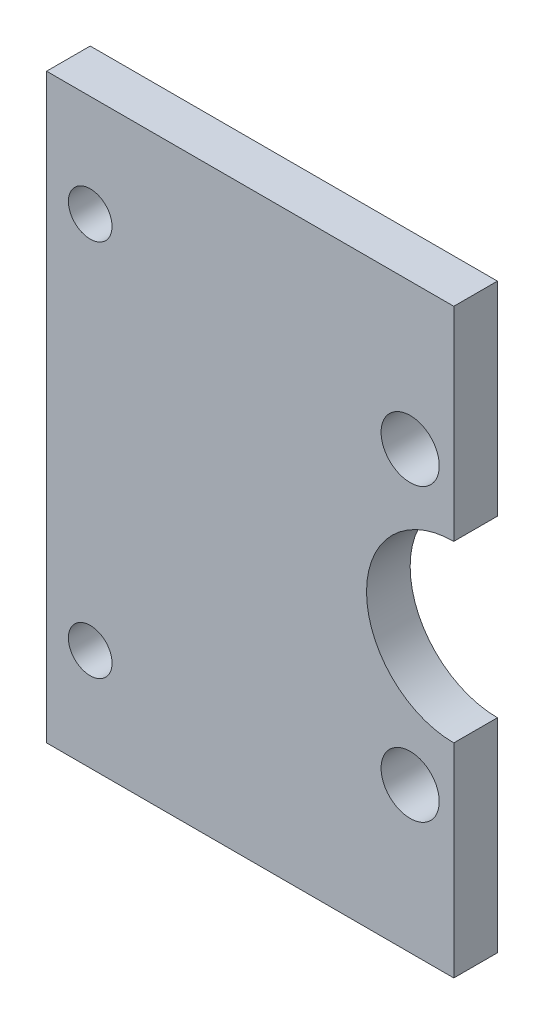
ISO-10303-21;
HEADER;
FILE_DESCRIPTION(('STEP AP214'),'2;1');
FILE_NAME('part.step','',(''),(''),'','','');
FILE_SCHEMA(('AUTOMOTIVE_DESIGN { 1 0 10303 214 1 1 1 1 }'));
ENDSEC;
DATA;
#1=APPLICATION_CONTEXT('core data for automotive mechanical design processes');
#2=APPLICATION_PROTOCOL_DEFINITION('international standard','automotive_design',2000,#1);
#3=PRODUCT_CONTEXT('',#1,'mechanical');
#4=PRODUCT('Part','Part','',(#3));
#5=PRODUCT_RELATED_PRODUCT_CATEGORY('part','',(#4));
#6=PRODUCT_DEFINITION_FORMATION('','',#4);
#7=PRODUCT_DEFINITION_CONTEXT('part definition',#1,'design');
#8=PRODUCT_DEFINITION('design','',#6,#7);
#9=PRODUCT_DEFINITION_SHAPE('','',#8);
#10=(LENGTH_UNIT() NAMED_UNIT(*) SI_UNIT(.MILLI.,.METRE.));
#11=(NAMED_UNIT(*) PLANE_ANGLE_UNIT() SI_UNIT($,.RADIAN.));
#12=(NAMED_UNIT(*) SI_UNIT($,.STERADIAN.) SOLID_ANGLE_UNIT());
#13=UNCERTAINTY_MEASURE_WITH_UNIT(LENGTH_MEASURE(1.E-05),#10,'distance_accuracy_value','');
#14=(GEOMETRIC_REPRESENTATION_CONTEXT(3) GLOBAL_UNCERTAINTY_ASSIGNED_CONTEXT((#13)) GLOBAL_UNIT_ASSIGNED_CONTEXT((#10,
#11,#12)) REPRESENTATION_CONTEXT('',''));
#15=CARTESIAN_POINT('',(0.,0.,0.));
#16=DIRECTION('',(0.,0.,1.));
#17=DIRECTION('',(1.,0.,0.));
#18=AXIS2_PLACEMENT_3D('',#15,#16,#17);
#19=CARTESIAN_POINT('',(14.,20.,3.));
#20=DIRECTION('',(1.,0.,0.));
#21=DIRECTION('',(0.,1.,0.));
#22=AXIS2_PLACEMENT_3D('',#19,#20,#21);
#23=PLANE('',#22);
#24=DIRECTION('',(0.,0.,1.));
#25=VECTOR('',#24,1.);
#26=CARTESIAN_POINT('',(14.,6.,-7.));
#27=LINE('',#26,#25);
#28=CARTESIAN_POINT('',(14.,6.,0.));
#29=VERTEX_POINT('',#28);
#30=CARTESIAN_POINT('',(14.,6.,3.));
#31=VERTEX_POINT('',#30);
#32=EDGE_CURVE('E11',#29,#31,#27,.T.);
#33=ORIENTED_EDGE('',*,*,#32,.F.);
#34=DIRECTION('',(0.,-1.,0.));
#35=VECTOR('',#34,1.);
#36=CARTESIAN_POINT('',(14.,20.,0.));
#37=LINE('',#36,#35);
#38=CARTESIAN_POINT('',(14.,20.,0.));
#39=VERTEX_POINT('',#38);
#40=EDGE_CURVE('E125',#39,#29,#37,.T.);
#41=ORIENTED_EDGE('',*,*,#40,.F.);
#42=DIRECTION('',(0.,0.,-1.));
#43=VECTOR('',#42,1.);
#44=CARTESIAN_POINT('',(14.,20.,3.));
#45=LINE('',#44,#43);
#46=CARTESIAN_POINT('',(14.,20.,3.));
#47=VERTEX_POINT('',#46);
#48=EDGE_CURVE('E111',#47,#39,#45,.T.);
#49=ORIENTED_EDGE('',*,*,#48,.F.);
#50=DIRECTION('',(0.,-1.,0.));
#51=VECTOR('',#50,1.);
#52=CARTESIAN_POINT('',(14.,20.,3.));
#53=LINE('',#52,#51);
#54=EDGE_CURVE('E108',#47,#31,#53,.T.);
#55=ORIENTED_EDGE('',*,*,#54,.T.);
#56=EDGE_LOOP('',(#33,#41,#49,#55));
#57=FACE_BOUND('',#56,.T.);
#58=ADVANCED_FACE('F35',(#57),#23,.T.);
#59=CARTESIAN_POINT('',(0.,0.,3.));
#60=DIRECTION('',(0.,0.,1.));
#61=DIRECTION('',(1.,0.,0.));
#62=AXIS2_PLACEMENT_3D('',#59,#60,#61);
#63=PLANE('',#62);
#64=CARTESIAN_POINT('',(14.,0.,3.));
#65=DIRECTION('',(0.,0.,1.));
#66=DIRECTION('',(1.,0.,0.));
#67=AXIS2_PLACEMENT_3D('',#64,#65,#66);
#68=CIRCLE('',#67,6.);
#69=CARTESIAN_POINT('',(14.,-6.,3.));
#70=VERTEX_POINT('',#69);
#71=EDGE_CURVE('E49',#31,#70,#68,.T.);
#72=ORIENTED_EDGE('',*,*,#71,.F.);
#73=ORIENTED_EDGE('',*,*,#54,.F.);
#74=DIRECTION('',(1.,0.,0.));
#75=VECTOR('',#74,1.);
#76=CARTESIAN_POINT('',(-14.,20.,3.));
#77=LINE('',#76,#75);
#78=CARTESIAN_POINT('',(-14.,20.,3.));
#79=VERTEX_POINT('',#78);
#80=EDGE_CURVE('E112',#79,#47,#77,.T.);
#81=ORIENTED_EDGE('',*,*,#80,.F.);
#82=DIRECTION('',(0.,-1.,0.));
#83=VECTOR('',#82,1.);
#84=CARTESIAN_POINT('',(-14.,20.,3.));
#85=LINE('',#84,#83);
#86=CARTESIAN_POINT('',(-14.,-20.,3.));
#87=VERTEX_POINT('',#86);
#88=EDGE_CURVE('E130',#79,#87,#85,.T.);
#89=ORIENTED_EDGE('',*,*,#88,.T.);
#90=DIRECTION('',(1.,0.,0.));
#91=VECTOR('',#90,1.);
#92=CARTESIAN_POINT('',(-14.,-20.,3.));
#93=LINE('',#92,#91);
#94=CARTESIAN_POINT('',(14.,-20.,3.));
#95=VERTEX_POINT('',#94);
#96=EDGE_CURVE('E85',#87,#95,#93,.T.);
#97=ORIENTED_EDGE('',*,*,#96,.T.);
#98=EDGE_CURVE('E109',#70,#95,#53,.T.);
#99=ORIENTED_EDGE('',*,*,#98,.F.);
#100=EDGE_LOOP('',(#72,#73,#81,#89,#97,#99));
#101=FACE_BOUND('',#100,.T.);
#102=CARTESIAN_POINT('',(-11.,-13.,3.));
#103=DIRECTION('',(0.,0.,-1.));
#104=DIRECTION('',(1.,0.,0.));
#105=AXIS2_PLACEMENT_3D('',#102,#103,#104);
#106=CIRCLE('',#105,1.5);
#107=CARTESIAN_POINT('',(-9.5,-13.,3.));
#108=VERTEX_POINT('',#107);
#109=EDGE_CURVE('E144',#108,#108,#106,.T.);
#110=ORIENTED_EDGE('',*,*,#109,.T.);
#111=EDGE_LOOP('',(#110));
#112=FACE_BOUND('',#111,.T.);
#113=CARTESIAN_POINT('',(-11.,13.,3.));
#114=DIRECTION('',(0.,0.,1.));
#115=DIRECTION('',(1.,0.,0.));
#116=AXIS2_PLACEMENT_3D('',#113,#114,#115);
#117=CIRCLE('',#116,1.5);
#118=CARTESIAN_POINT('',(-9.5,13.,3.));
#119=VERTEX_POINT('',#118);
#120=EDGE_CURVE('E140',#119,#119,#117,.T.);
#121=ORIENTED_EDGE('',*,*,#120,.F.);
#122=EDGE_LOOP('',(#121));
#123=FACE_BOUND('',#122,.T.);
#124=CARTESIAN_POINT('',(11.,10.,3.));
#125=DIRECTION('',(0.,0.,1.));
#126=DIRECTION('',(1.,0.,0.));
#127=AXIS2_PLACEMENT_3D('',#124,#125,#126);
#128=CIRCLE('',#127,2.);
#129=CARTESIAN_POINT('',(13.,10.,3.));
#130=VERTEX_POINT('',#129);
#131=EDGE_CURVE('E148',#130,#130,#128,.T.);
#132=ORIENTED_EDGE('',*,*,#131,.F.);
#133=EDGE_LOOP('',(#132));
#134=FACE_BOUND('',#133,.T.);
#135=CARTESIAN_POINT('',(11.,-10.,3.));
#136=DIRECTION('',(0.,0.,-1.));
#137=DIRECTION('',(1.,0.,0.));
#138=AXIS2_PLACEMENT_3D('',#135,#136,#137);
#139=CIRCLE('',#138,2.);
#140=CARTESIAN_POINT('',(13.,-10.,3.));
#141=VERTEX_POINT('',#140);
#142=EDGE_CURVE('E151',#141,#141,#139,.T.);
#143=ORIENTED_EDGE('',*,*,#142,.T.);
#144=EDGE_LOOP('',(#143));
#145=FACE_BOUND('',#144,.T.);
#146=ADVANCED_FACE('F105',(#101,#112,#123,#134,#145),#63,.T.);
#147=CARTESIAN_POINT('',(0.,0.,0.));
#148=DIRECTION('',(0.,0.,1.));
#149=DIRECTION('',(1.,0.,0.));
#150=AXIS2_PLACEMENT_3D('',#147,#148,#149);
#151=PLANE('',#150);
#152=CARTESIAN_POINT('',(-11.,-13.,0.));
#153=DIRECTION('',(0.,0.,1.));
#154=DIRECTION('',(1.,0.,0.));
#155=AXIS2_PLACEMENT_3D('',#152,#153,#154);
#156=CIRCLE('',#155,1.5);
#157=CARTESIAN_POINT('',(-9.5,-13.,0.));
#158=VERTEX_POINT('',#157);
#159=EDGE_CURVE('E141',#158,#158,#156,.F.);
#160=ORIENTED_EDGE('',*,*,#159,.F.);
#161=EDGE_LOOP('',(#160));
#162=FACE_BOUND('',#161,.T.);
#163=CARTESIAN_POINT('',(-11.,13.,0.));
#164=DIRECTION('',(0.,0.,1.));
#165=DIRECTION('',(1.,0.,0.));
#166=AXIS2_PLACEMENT_3D('',#163,#164,#165);
#167=CIRCLE('',#166,1.5);
#168=CARTESIAN_POINT('',(-9.5,13.,0.));
#169=VERTEX_POINT('',#168);
#170=EDGE_CURVE('E121',#169,#169,#167,.T.);
#171=ORIENTED_EDGE('',*,*,#170,.T.);
#172=EDGE_LOOP('',(#171));
#173=FACE_BOUND('',#172,.T.);
#174=ORIENTED_EDGE('',*,*,#40,.T.);
#175=CARTESIAN_POINT('',(14.,0.,0.));
#176=DIRECTION('',(0.,0.,1.));
#177=DIRECTION('',(1.,0.,0.));
#178=AXIS2_PLACEMENT_3D('',#175,#176,#177);
#179=CIRCLE('',#178,6.);
#180=CARTESIAN_POINT('',(14.,-6.,0.));
#181=VERTEX_POINT('',#180);
#182=EDGE_CURVE('E97',#29,#181,#179,.T.);
#183=ORIENTED_EDGE('',*,*,#182,.T.);
#184=CARTESIAN_POINT('',(14.,-20.,0.));
#185=VERTEX_POINT('',#184);
#186=EDGE_CURVE('E124',#181,#185,#37,.T.);
#187=ORIENTED_EDGE('',*,*,#186,.T.);
#188=DIRECTION('',(1.,0.,0.));
#189=VECTOR('',#188,1.);
#190=CARTESIAN_POINT('',(-14.,-20.,0.));
#191=LINE('',#190,#189);
#192=CARTESIAN_POINT('',(-14.,-20.,0.));
#193=VERTEX_POINT('',#192);
#194=EDGE_CURVE('E120',#193,#185,#191,.T.);
#195=ORIENTED_EDGE('',*,*,#194,.F.);
#196=DIRECTION('',(0.,-1.,0.));
#197=VECTOR('',#196,1.);
#198=CARTESIAN_POINT('',(-14.,20.,0.));
#199=LINE('',#198,#197);
#200=CARTESIAN_POINT('',(-14.,20.,0.));
#201=VERTEX_POINT('',#200);
#202=EDGE_CURVE('E118',#201,#193,#199,.T.);
#203=ORIENTED_EDGE('',*,*,#202,.F.);
#204=DIRECTION('',(1.,0.,0.));
#205=VECTOR('',#204,1.);
#206=CARTESIAN_POINT('',(-14.,20.,0.));
#207=LINE('',#206,#205);
#208=EDGE_CURVE('E127',#201,#39,#207,.T.);
#209=ORIENTED_EDGE('',*,*,#208,.T.);
#210=EDGE_LOOP('',(#174,#183,#187,#195,#203,#209));
#211=FACE_BOUND('',#210,.T.);
#212=CARTESIAN_POINT('',(11.,10.,0.));
#213=DIRECTION('',(0.,0.,1.));
#214=DIRECTION('',(1.,0.,0.));
#215=AXIS2_PLACEMENT_3D('',#212,#213,#214);
#216=CIRCLE('',#215,2.);
#217=CARTESIAN_POINT('',(13.,10.,0.));
#218=VERTEX_POINT('',#217);
#219=EDGE_CURVE('E145',#218,#218,#216,.T.);
#220=ORIENTED_EDGE('',*,*,#219,.T.);
#221=EDGE_LOOP('',(#220));
#222=FACE_BOUND('',#221,.T.);
#223=CARTESIAN_POINT('',(11.,-10.,0.));
#224=DIRECTION('',(0.,0.,1.));
#225=DIRECTION('',(1.,0.,0.));
#226=AXIS2_PLACEMENT_3D('',#223,#224,#225);
#227=CIRCLE('',#226,2.);
#228=CARTESIAN_POINT('',(13.,-10.,0.));
#229=VERTEX_POINT('',#228);
#230=EDGE_CURVE('E149',#229,#229,#227,.F.);
#231=ORIENTED_EDGE('',*,*,#230,.F.);
#232=EDGE_LOOP('',(#231));
#233=FACE_BOUND('',#232,.T.);
#234=ADVANCED_FACE('F155',(#162,#173,#211,#222,#233),#151,.F.);
#235=CARTESIAN_POINT('',(-14.,20.,3.));
#236=DIRECTION('',(1.,0.,0.));
#237=DIRECTION('',(0.,1.,0.));
#238=AXIS2_PLACEMENT_3D('',#235,#236,#237);
#239=PLANE('',#238);
#240=ORIENTED_EDGE('',*,*,#202,.T.);
#241=DIRECTION('',(0.,0.,-1.));
#242=VECTOR('',#241,1.);
#243=CARTESIAN_POINT('',(-14.,-20.,3.));
#244=LINE('',#243,#242);
#245=EDGE_CURVE('E136',#87,#193,#244,.T.);
#246=ORIENTED_EDGE('',*,*,#245,.F.);
#247=ORIENTED_EDGE('',*,*,#88,.F.);
#248=DIRECTION('',(0.,0.,-1.));
#249=VECTOR('',#248,1.);
#250=CARTESIAN_POINT('',(-14.,20.,3.));
#251=LINE('',#250,#249);
#252=EDGE_CURVE('E58',#79,#201,#251,.T.);
#253=ORIENTED_EDGE('',*,*,#252,.T.);
#254=EDGE_LOOP('',(#240,#246,#247,#253));
#255=FACE_BOUND('',#254,.T.);
#256=ADVANCED_FACE('F37',(#255),#239,.F.);
#257=CARTESIAN_POINT('',(-14.,-20.,3.));
#258=DIRECTION('',(0.,1.,0.));
#259=DIRECTION('',(0.,0.,1.));
#260=AXIS2_PLACEMENT_3D('',#257,#258,#259);
#261=PLANE('',#260);
#262=ORIENTED_EDGE('',*,*,#194,.T.);
#263=DIRECTION('',(0.,0.,-1.));
#264=VECTOR('',#263,1.);
#265=CARTESIAN_POINT('',(14.,-20.,3.));
#266=LINE('',#265,#264);
#267=EDGE_CURVE('E133',#95,#185,#266,.T.);
#268=ORIENTED_EDGE('',*,*,#267,.F.);
#269=ORIENTED_EDGE('',*,*,#96,.F.);
#270=ORIENTED_EDGE('',*,*,#245,.T.);
#271=EDGE_LOOP('',(#262,#268,#269,#270));
#272=FACE_BOUND('',#271,.T.);
#273=ADVANCED_FACE('F159',(#272),#261,.F.);
#274=DIRECTION('',(0.,0.,1.));
#275=VECTOR('',#274,1.);
#276=CARTESIAN_POINT('',(14.,-6.,-7.));
#277=LINE('',#276,#275);
#278=EDGE_CURVE('E43',#70,#181,#277,.F.);
#279=ORIENTED_EDGE('',*,*,#278,.F.);
#280=ORIENTED_EDGE('',*,*,#98,.T.);
#281=ORIENTED_EDGE('',*,*,#267,.T.);
#282=ORIENTED_EDGE('',*,*,#186,.F.);
#283=EDGE_LOOP('',(#279,#280,#281,#282));
#284=FACE_BOUND('',#283,.T.);
#285=ADVANCED_FACE('F158',(#284),#23,.T.);
#286=CARTESIAN_POINT('',(-14.,20.,3.));
#287=DIRECTION('',(0.,1.,0.));
#288=DIRECTION('',(0.,0.,1.));
#289=AXIS2_PLACEMENT_3D('',#286,#287,#288);
#290=PLANE('',#289);
#291=ORIENTED_EDGE('',*,*,#208,.F.);
#292=ORIENTED_EDGE('',*,*,#252,.F.);
#293=ORIENTED_EDGE('',*,*,#80,.T.);
#294=ORIENTED_EDGE('',*,*,#48,.T.);
#295=EDGE_LOOP('',(#291,#292,#293,#294));
#296=FACE_BOUND('',#295,.T.);
#297=ADVANCED_FACE('F161',(#296),#290,.T.);
#298=CARTESIAN_POINT('',(-11.,13.,-2.));
#299=DIRECTION('',(0.,0.,1.));
#300=DIRECTION('',(1.,0.,0.));
#301=AXIS2_PLACEMENT_3D('',#298,#299,#300);
#302=CYLINDRICAL_SURFACE('',#301,1.5);
#303=ORIENTED_EDGE('',*,*,#120,.T.);
#304=EDGE_LOOP('',(#303));
#305=FACE_BOUND('',#304,.T.);
#306=ORIENTED_EDGE('',*,*,#170,.F.);
#307=EDGE_LOOP('',(#306));
#308=FACE_BOUND('',#307,.T.);
#309=ADVANCED_FACE('F180',(#305,#308),#302,.F.);
#310=CARTESIAN_POINT('',(-11.,-13.,-2.));
#311=DIRECTION('',(0.,0.,1.));
#312=DIRECTION('',(1.,0.,0.));
#313=AXIS2_PLACEMENT_3D('',#310,#311,#312);
#314=CYLINDRICAL_SURFACE('',#313,1.5);
#315=ORIENTED_EDGE('',*,*,#109,.F.);
#316=EDGE_LOOP('',(#315));
#317=FACE_BOUND('',#316,.T.);
#318=ORIENTED_EDGE('',*,*,#159,.T.);
#319=EDGE_LOOP('',(#318));
#320=FACE_BOUND('',#319,.T.);
#321=ADVANCED_FACE('F184',(#317,#320),#314,.F.);
#322=CARTESIAN_POINT('',(11.,10.,-7.));
#323=DIRECTION('',(0.,0.,1.));
#324=DIRECTION('',(1.,0.,0.));
#325=AXIS2_PLACEMENT_3D('',#322,#323,#324);
#326=CYLINDRICAL_SURFACE('',#325,2.);
#327=ORIENTED_EDGE('',*,*,#131,.T.);
#328=EDGE_LOOP('',(#327));
#329=FACE_BOUND('',#328,.T.);
#330=ORIENTED_EDGE('',*,*,#219,.F.);
#331=EDGE_LOOP('',(#330));
#332=FACE_BOUND('',#331,.T.);
#333=ADVANCED_FACE('F190',(#329,#332),#326,.F.);
#334=CARTESIAN_POINT('',(11.,-10.,-7.));
#335=DIRECTION('',(0.,0.,1.));
#336=DIRECTION('',(1.,0.,0.));
#337=AXIS2_PLACEMENT_3D('',#334,#335,#336);
#338=CYLINDRICAL_SURFACE('',#337,2.);
#339=ORIENTED_EDGE('',*,*,#142,.F.);
#340=EDGE_LOOP('',(#339));
#341=FACE_BOUND('',#340,.T.);
#342=ORIENTED_EDGE('',*,*,#230,.T.);
#343=EDGE_LOOP('',(#342));
#344=FACE_BOUND('',#343,.T.);
#345=ADVANCED_FACE('F194',(#341,#344),#338,.F.);
#346=CARTESIAN_POINT('',(14.,0.,-7.));
#347=DIRECTION('',(0.,0.,1.));
#348=DIRECTION('',(1.,0.,0.));
#349=AXIS2_PLACEMENT_3D('',#346,#347,#348);
#350=CYLINDRICAL_SURFACE('',#349,6.);
#351=ORIENTED_EDGE('',*,*,#32,.T.);
#352=ORIENTED_EDGE('',*,*,#71,.T.);
#353=ORIENTED_EDGE('',*,*,#278,.T.);
#354=ORIENTED_EDGE('',*,*,#182,.F.);
#355=EDGE_LOOP('',(#351,#352,#353,#354));
#356=FACE_BOUND('',#355,.T.);
#357=ADVANCED_FACE('F95',(#356),#350,.F.);
#358=CLOSED_SHELL('',(#58,#146,#234,#256,#273,#285,#297,#309,#321,#333,#345,#357));
#359=MANIFOLD_SOLID_BREP('B2',#358);
#360=ADVANCED_BREP_SHAPE_REPRESENTATION('',(#18,#359),#14);
#361=SHAPE_DEFINITION_REPRESENTATION(#9,#360);
ENDSEC;
END-ISO-10303-21;
